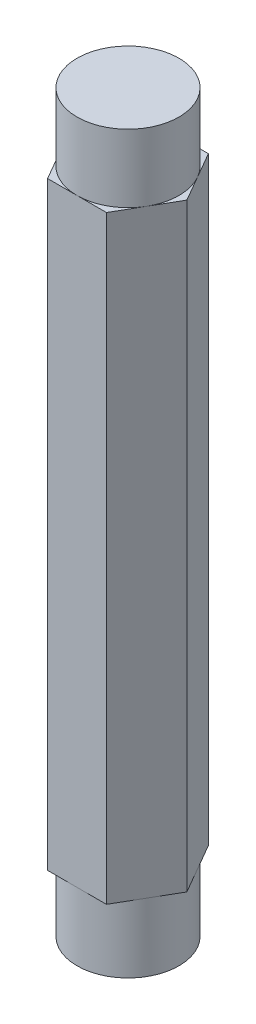
ISO-10303-21;
HEADER;
FILE_DESCRIPTION(('STEP AP214'),'2;1');
FILE_NAME('part.step','',(''),(''),'','','');
FILE_SCHEMA(('AUTOMOTIVE_DESIGN { 1 0 10303 214 1 1 1 1 }'));
ENDSEC;
DATA;
#1=APPLICATION_CONTEXT('core data for automotive mechanical design processes');
#2=APPLICATION_PROTOCOL_DEFINITION('international standard','automotive_design',2000,#1);
#3=PRODUCT_CONTEXT('',#1,'mechanical');
#4=PRODUCT('Part','Part','',(#3));
#5=PRODUCT_RELATED_PRODUCT_CATEGORY('part','',(#4));
#6=PRODUCT_DEFINITION_FORMATION('','',#4);
#7=PRODUCT_DEFINITION_CONTEXT('part definition',#1,'design');
#8=PRODUCT_DEFINITION('design','',#6,#7);
#9=PRODUCT_DEFINITION_SHAPE('','',#8);
#10=(LENGTH_UNIT() NAMED_UNIT(*) SI_UNIT(.MILLI.,.METRE.));
#11=(NAMED_UNIT(*) PLANE_ANGLE_UNIT() SI_UNIT($,.RADIAN.));
#12=(NAMED_UNIT(*) SI_UNIT($,.STERADIAN.) SOLID_ANGLE_UNIT());
#13=UNCERTAINTY_MEASURE_WITH_UNIT(LENGTH_MEASURE(1.E-05),#10,'distance_accuracy_value','');
#14=(GEOMETRIC_REPRESENTATION_CONTEXT(3) GLOBAL_UNCERTAINTY_ASSIGNED_CONTEXT((#13)) GLOBAL_UNIT_ASSIGNED_CONTEXT((#10,
#11,#12)) REPRESENTATION_CONTEXT('',''));
#15=CARTESIAN_POINT('',(0.,0.,0.));
#16=DIRECTION('',(0.,0.,1.));
#17=DIRECTION('',(1.,0.,0.));
#18=AXIS2_PLACEMENT_3D('',#15,#16,#17);
#19=CARTESIAN_POINT('',(0.,-13.9954,0.));
#20=DIRECTION('',(0.,1.,0.));
#21=DIRECTION('',(0.,0.,1.));
#22=AXIS2_PLACEMENT_3D('',#19,#20,#21);
#23=PLANE('',#22);
#24=DIRECTION('',(1.,0.,0.));
#25=VECTOR('',#24,1.);
#26=CARTESIAN_POINT('',(-1.3748153285078,-13.9954,2.38125));
#27=LINE('',#26,#25);
#28=CARTESIAN_POINT('',(0.,-13.9954,2.38125));
#29=VERTEX_POINT('',#28);
#30=CARTESIAN_POINT('',(1.3748153285078,-13.9954,2.38125));
#31=VERTEX_POINT('',#30);
#32=EDGE_CURVE('E140',#29,#31,#27,.T.);
#33=ORIENTED_EDGE('',*,*,#32,.F.);
#34=CARTESIAN_POINT('',(0.,-13.9954,0.));
#35=DIRECTION('',(0.,1.,0.));
#36=DIRECTION('',(0.,0.,1.));
#37=AXIS2_PLACEMENT_3D('',#34,#35,#36);
#38=CIRCLE('',#37,2.38125);
#39=CARTESIAN_POINT('',(2.06222299276169,-13.9954,1.190625));
#40=VERTEX_POINT('',#39);
#41=EDGE_CURVE('E51',#29,#40,#38,.T.);
#42=ORIENTED_EDGE('',*,*,#41,.T.);
#43=DIRECTION('',(0.5,0.,-0.866025403784439));
#44=VECTOR('',#43,1.);
#45=CARTESIAN_POINT('',(1.3748153285078,-13.9954,2.38125));
#46=LINE('',#45,#44);
#47=EDGE_CURVE('E138',#31,#40,#46,.T.);
#48=ORIENTED_EDGE('',*,*,#47,.F.);
#49=EDGE_LOOP('',(#33,#42,#48));
#50=FACE_BOUND('',#49,.T.);
#51=ADVANCED_FACE('F39',(#50),#23,.F.);
#52=CARTESIAN_POINT('',(2.74963065701559,-13.9954,0.));
#53=VERTEX_POINT('',#52);
#54=EDGE_CURVE('E145',#40,#53,#46,.T.);
#55=ORIENTED_EDGE('',*,*,#54,.F.);
#56=CARTESIAN_POINT('',(2.06222299276169,-13.9954,-1.190625));
#57=VERTEX_POINT('',#56);
#58=EDGE_CURVE('E11',#40,#57,#38,.T.);
#59=ORIENTED_EDGE('',*,*,#58,.T.);
#60=DIRECTION('',(-0.5,0.,-0.866025403784439));
#61=VECTOR('',#60,1.);
#62=CARTESIAN_POINT('',(2.74963065701559,-13.9954,0.));
#63=LINE('',#62,#61);
#64=EDGE_CURVE('E148',#53,#57,#63,.T.);
#65=ORIENTED_EDGE('',*,*,#64,.F.);
#66=EDGE_LOOP('',(#55,#59,#65));
#67=FACE_BOUND('',#66,.T.);
#68=ADVANCED_FACE('F146',(#67),#23,.F.);
#69=CARTESIAN_POINT('',(1.37481532850779,-13.9954,-2.38125));
#70=VERTEX_POINT('',#69);
#71=EDGE_CURVE('E159',#57,#70,#63,.T.);
#72=ORIENTED_EDGE('',*,*,#71,.F.);
#73=CARTESIAN_POINT('',(0.,-13.9954,-2.38125));
#74=VERTEX_POINT('',#73);
#75=EDGE_CURVE('E49',#57,#74,#38,.T.);
#76=ORIENTED_EDGE('',*,*,#75,.T.);
#77=DIRECTION('',(-1.,0.,0.));
#78=VECTOR('',#77,1.);
#79=CARTESIAN_POINT('',(1.37481532850779,-13.9954,-2.38125));
#80=LINE('',#79,#78);
#81=EDGE_CURVE('E167',#70,#74,#80,.T.);
#82=ORIENTED_EDGE('',*,*,#81,.F.);
#83=EDGE_LOOP('',(#72,#76,#82));
#84=FACE_BOUND('',#83,.T.);
#85=ADVANCED_FACE('F294',(#84),#23,.F.);
#86=CARTESIAN_POINT('',(-1.3748153285078,-13.9954,-2.38125));
#87=VERTEX_POINT('',#86);
#88=EDGE_CURVE('E166',#74,#87,#80,.T.);
#89=ORIENTED_EDGE('',*,*,#88,.F.);
#90=CARTESIAN_POINT('',(-2.06222299276169,-13.9954,-1.190625));
#91=VERTEX_POINT('',#90);
#92=EDGE_CURVE('E297',#74,#91,#38,.T.);
#93=ORIENTED_EDGE('',*,*,#92,.T.);
#94=DIRECTION('',(-0.5,0.,0.866025403784439));
#95=VECTOR('',#94,1.);
#96=CARTESIAN_POINT('',(-1.3748153285078,-13.9954,-2.38125));
#97=LINE('',#96,#95);
#98=EDGE_CURVE('E172',#87,#91,#97,.T.);
#99=ORIENTED_EDGE('',*,*,#98,.F.);
#100=EDGE_LOOP('',(#89,#93,#99));
#101=FACE_BOUND('',#100,.T.);
#102=ADVANCED_FACE('F301',(#101),#23,.F.);
#103=CARTESIAN_POINT('',(-2.74963065701559,-13.9954,0.));
#104=VERTEX_POINT('',#103);
#105=EDGE_CURVE('E171',#91,#104,#97,.T.);
#106=ORIENTED_EDGE('',*,*,#105,.F.);
#107=CARTESIAN_POINT('',(-2.06222299276169,-13.9954,1.190625));
#108=VERTEX_POINT('',#107);
#109=EDGE_CURVE('E229',#91,#108,#38,.T.);
#110=ORIENTED_EDGE('',*,*,#109,.T.);
#111=DIRECTION('',(0.5,0.,0.866025403784439));
#112=VECTOR('',#111,1.);
#113=CARTESIAN_POINT('',(-2.74963065701559,-13.9954,0.));
#114=LINE('',#113,#112);
#115=EDGE_CURVE('E177',#104,#108,#114,.T.);
#116=ORIENTED_EDGE('',*,*,#115,.F.);
#117=EDGE_LOOP('',(#106,#110,#116));
#118=FACE_BOUND('',#117,.T.);
#119=ADVANCED_FACE('F313',(#118),#23,.F.);
#120=CARTESIAN_POINT('',(0.,13.9954,0.));
#121=DIRECTION('',(0.,1.,0.));
#122=DIRECTION('',(0.,0.,1.));
#123=AXIS2_PLACEMENT_3D('',#120,#121,#122);
#124=PLANE('',#123);
#125=CARTESIAN_POINT('',(0.,13.9954,0.));
#126=DIRECTION('',(0.,1.,0.));
#127=DIRECTION('',(0.,0.,1.));
#128=AXIS2_PLACEMENT_3D('',#125,#126,#127);
#129=CIRCLE('',#128,2.38125);
#130=CARTESIAN_POINT('',(0.,13.9954,2.38125));
#131=VERTEX_POINT('',#130);
#132=CARTESIAN_POINT('',(2.06222299276169,13.9954,1.190625));
#133=VERTEX_POINT('',#132);
#134=EDGE_CURVE('E206',#131,#133,#129,.T.);
#135=ORIENTED_EDGE('',*,*,#134,.F.);
#136=DIRECTION('',(1.,0.,0.));
#137=VECTOR('',#136,1.);
#138=CARTESIAN_POINT('',(-1.3748153285078,13.9954,2.38125));
#139=LINE('',#138,#137);
#140=CARTESIAN_POINT('',(1.3748153285078,13.9954,2.38125));
#141=VERTEX_POINT('',#140);
#142=EDGE_CURVE('E181',#131,#141,#139,.T.);
#143=ORIENTED_EDGE('',*,*,#142,.T.);
#144=DIRECTION('',(0.5,0.,-0.866025403784439));
#145=VECTOR('',#144,1.);
#146=CARTESIAN_POINT('',(1.3748153285078,13.9954,2.38125));
#147=LINE('',#146,#145);
#148=EDGE_CURVE('E281',#141,#133,#147,.T.);
#149=ORIENTED_EDGE('',*,*,#148,.T.);
#150=EDGE_LOOP('',(#135,#143,#149));
#151=FACE_BOUND('',#150,.T.);
#152=ADVANCED_FACE('F329',(#151),#124,.T.);
#153=CARTESIAN_POINT('',(2.06222299276169,13.9954,-1.190625));
#154=VERTEX_POINT('',#153);
#155=EDGE_CURVE('E216',#133,#154,#129,.T.);
#156=ORIENTED_EDGE('',*,*,#155,.F.);
#157=CARTESIAN_POINT('',(2.74963065701559,13.9954,0.));
#158=VERTEX_POINT('',#157);
#159=EDGE_CURVE('E278',#133,#158,#147,.T.);
#160=ORIENTED_EDGE('',*,*,#159,.T.);
#161=DIRECTION('',(-0.5,0.,-0.866025403784439));
#162=VECTOR('',#161,1.);
#163=CARTESIAN_POINT('',(2.74963065701559,13.9954,0.));
#164=LINE('',#163,#162);
#165=EDGE_CURVE('E247',#158,#154,#164,.T.);
#166=ORIENTED_EDGE('',*,*,#165,.T.);
#167=EDGE_LOOP('',(#156,#160,#166));
#168=FACE_BOUND('',#167,.T.);
#169=ADVANCED_FACE('F289',(#168),#124,.T.);
#170=CARTESIAN_POINT('',(0.,13.9954,-2.38125));
#171=VERTEX_POINT('',#170);
#172=EDGE_CURVE('E225',#154,#171,#129,.T.);
#173=ORIENTED_EDGE('',*,*,#172,.F.);
#174=CARTESIAN_POINT('',(1.37481532850779,13.9954,-2.38125));
#175=VERTEX_POINT('',#174);
#176=EDGE_CURVE('E252',#154,#175,#164,.T.);
#177=ORIENTED_EDGE('',*,*,#176,.T.);
#178=DIRECTION('',(-1.,0.,0.));
#179=VECTOR('',#178,1.);
#180=CARTESIAN_POINT('',(1.37481532850779,13.9954,-2.38125));
#181=LINE('',#180,#179);
#182=EDGE_CURVE('E245',#175,#171,#181,.T.);
#183=ORIENTED_EDGE('',*,*,#182,.T.);
#184=EDGE_LOOP('',(#173,#177,#183));
#185=FACE_BOUND('',#184,.T.);
#186=ADVANCED_FACE('F250',(#185),#124,.T.);
#187=CARTESIAN_POINT('',(-2.06222299276169,13.9954,-1.190625));
#188=VERTEX_POINT('',#187);
#189=EDGE_CURVE('E211',#171,#188,#129,.T.);
#190=ORIENTED_EDGE('',*,*,#189,.F.);
#191=CARTESIAN_POINT('',(-1.3748153285078,13.9954,-2.38125));
#192=VERTEX_POINT('',#191);
#193=EDGE_CURVE('E237',#171,#192,#181,.T.);
#194=ORIENTED_EDGE('',*,*,#193,.T.);
#195=DIRECTION('',(-0.5,0.,0.866025403784439));
#196=VECTOR('',#195,1.);
#197=CARTESIAN_POINT('',(-1.3748153285078,13.9954,-2.38125));
#198=LINE('',#197,#196);
#199=EDGE_CURVE('E240',#192,#188,#198,.T.);
#200=ORIENTED_EDGE('',*,*,#199,.T.);
#201=EDGE_LOOP('',(#190,#194,#200));
#202=FACE_BOUND('',#201,.T.);
#203=ADVANCED_FACE('F236',(#202),#124,.T.);
#204=CARTESIAN_POINT('',(-2.06222299276169,13.9954,1.190625));
#205=VERTEX_POINT('',#204);
#206=EDGE_CURVE('E204',#188,#205,#129,.T.);
#207=ORIENTED_EDGE('',*,*,#206,.F.);
#208=CARTESIAN_POINT('',(-2.74963065701559,13.9954,0.));
#209=VERTEX_POINT('',#208);
#210=EDGE_CURVE('E255',#188,#209,#198,.T.);
#211=ORIENTED_EDGE('',*,*,#210,.T.);
#212=DIRECTION('',(0.5,0.,0.866025403784439));
#213=VECTOR('',#212,1.);
#214=CARTESIAN_POINT('',(-2.74963065701559,13.9954,0.));
#215=LINE('',#214,#213);
#216=EDGE_CURVE('E187',#209,#205,#215,.T.);
#217=ORIENTED_EDGE('',*,*,#216,.T.);
#218=EDGE_LOOP('',(#207,#211,#217));
#219=FACE_BOUND('',#218,.T.);
#220=ADVANCED_FACE('F330',(#219),#124,.T.);
#221=CARTESIAN_POINT('',(-1.3748153285078,13.9954,2.38125));
#222=DIRECTION('',(0.,0.,-1.));
#223=DIRECTION('',(-1.,0.,0.));
#224=AXIS2_PLACEMENT_3D('',#221,#222,#223);
#225=PLANE('',#224);
#226=CARTESIAN_POINT('',(-1.3748153285078,-13.9954,2.38125));
#227=VERTEX_POINT('',#226);
#228=EDGE_CURVE('E153',#227,#29,#27,.T.);
#229=ORIENTED_EDGE('',*,*,#228,.T.);
#230=ORIENTED_EDGE('',*,*,#32,.T.);
#231=DIRECTION('',(0.,-1.,0.));
#232=VECTOR('',#231,1.);
#233=CARTESIAN_POINT('',(1.3748153285078,13.9954,2.38125));
#234=LINE('',#233,#232);
#235=EDGE_CURVE('E43',#141,#31,#234,.T.);
#236=ORIENTED_EDGE('',*,*,#235,.F.);
#237=ORIENTED_EDGE('',*,*,#142,.F.);
#238=CARTESIAN_POINT('',(-1.3748153285078,13.9954,2.38125));
#239=VERTEX_POINT('',#238);
#240=EDGE_CURVE('E270',#239,#131,#139,.T.);
#241=ORIENTED_EDGE('',*,*,#240,.F.);
#242=DIRECTION('',(0.,-1.,0.));
#243=VECTOR('',#242,1.);
#244=CARTESIAN_POINT('',(-1.3748153285078,13.9954,2.38125));
#245=LINE('',#244,#243);
#246=EDGE_CURVE('E182',#239,#227,#245,.T.);
#247=ORIENTED_EDGE('',*,*,#246,.T.);
#248=EDGE_LOOP('',(#229,#230,#236,#237,#241,#247));
#249=FACE_BOUND('',#248,.T.);
#250=ADVANCED_FACE('F41',(#249),#225,.F.);
#251=CARTESIAN_POINT('',(1.3748153285078,13.9954,2.38125));
#252=DIRECTION('',(-0.866025403784439,0.,-0.5));
#253=DIRECTION('',(-0.5,0.,0.866025403784439));
#254=AXIS2_PLACEMENT_3D('',#251,#252,#253);
#255=PLANE('',#254);
#256=ORIENTED_EDGE('',*,*,#47,.T.);
#257=ORIENTED_EDGE('',*,*,#54,.T.);
#258=DIRECTION('',(0.,-1.,0.));
#259=VECTOR('',#258,1.);
#260=CARTESIAN_POINT('',(2.74963065701559,13.9954,0.));
#261=LINE('',#260,#259);
#262=EDGE_CURVE('E198',#158,#53,#261,.T.);
#263=ORIENTED_EDGE('',*,*,#262,.F.);
#264=ORIENTED_EDGE('',*,*,#159,.F.);
#265=ORIENTED_EDGE('',*,*,#148,.F.);
#266=ORIENTED_EDGE('',*,*,#235,.T.);
#267=EDGE_LOOP('',(#256,#257,#263,#264,#265,#266));
#268=FACE_BOUND('',#267,.T.);
#269=ADVANCED_FACE('F155',(#268),#255,.F.);
#270=CARTESIAN_POINT('',(2.74963065701559,13.9954,0.));
#271=DIRECTION('',(-0.866025403784439,0.,0.5));
#272=DIRECTION('',(0.5,0.,0.866025403784439));
#273=AXIS2_PLACEMENT_3D('',#270,#271,#272);
#274=PLANE('',#273);
#275=ORIENTED_EDGE('',*,*,#64,.T.);
#276=ORIENTED_EDGE('',*,*,#71,.T.);
#277=DIRECTION('',(0.,-1.,0.));
#278=VECTOR('',#277,1.);
#279=CARTESIAN_POINT('',(1.37481532850779,13.9954,-2.38125));
#280=LINE('',#279,#278);
#281=EDGE_CURVE('E195',#175,#70,#280,.T.);
#282=ORIENTED_EDGE('',*,*,#281,.F.);
#283=ORIENTED_EDGE('',*,*,#176,.F.);
#284=ORIENTED_EDGE('',*,*,#165,.F.);
#285=ORIENTED_EDGE('',*,*,#262,.T.);
#286=EDGE_LOOP('',(#275,#276,#282,#283,#284,#285));
#287=FACE_BOUND('',#286,.T.);
#288=ADVANCED_FACE('F291',(#287),#274,.F.);
#289=CARTESIAN_POINT('',(1.37481532850779,13.9954,-2.38125));
#290=DIRECTION('',(0.,0.,1.));
#291=DIRECTION('',(1.,0.,0.));
#292=AXIS2_PLACEMENT_3D('',#289,#290,#291);
#293=PLANE('',#292);
#294=ORIENTED_EDGE('',*,*,#81,.T.);
#295=ORIENTED_EDGE('',*,*,#88,.T.);
#296=DIRECTION('',(0.,-1.,0.));
#297=VECTOR('',#296,1.);
#298=CARTESIAN_POINT('',(-1.3748153285078,13.9954,-2.38125));
#299=LINE('',#298,#297);
#300=EDGE_CURVE('E191',#192,#87,#299,.T.);
#301=ORIENTED_EDGE('',*,*,#300,.F.);
#302=ORIENTED_EDGE('',*,*,#193,.F.);
#303=ORIENTED_EDGE('',*,*,#182,.F.);
#304=ORIENTED_EDGE('',*,*,#281,.T.);
#305=EDGE_LOOP('',(#294,#295,#301,#302,#303,#304));
#306=FACE_BOUND('',#305,.T.);
#307=ADVANCED_FACE('F244',(#306),#293,.F.);
#308=CARTESIAN_POINT('',(-1.3748153285078,13.9954,-2.38125));
#309=DIRECTION('',(0.866025403784439,0.,0.5));
#310=DIRECTION('',(0.5,0.,-0.866025403784439));
#311=AXIS2_PLACEMENT_3D('',#308,#309,#310);
#312=PLANE('',#311);
#313=ORIENTED_EDGE('',*,*,#98,.T.);
#314=ORIENTED_EDGE('',*,*,#105,.T.);
#315=DIRECTION('',(0.,-1.,0.));
#316=VECTOR('',#315,1.);
#317=CARTESIAN_POINT('',(-2.74963065701559,13.9954,0.));
#318=LINE('',#317,#316);
#319=EDGE_CURVE('E186',#209,#104,#318,.T.);
#320=ORIENTED_EDGE('',*,*,#319,.F.);
#321=ORIENTED_EDGE('',*,*,#210,.F.);
#322=ORIENTED_EDGE('',*,*,#199,.F.);
#323=ORIENTED_EDGE('',*,*,#300,.T.);
#324=EDGE_LOOP('',(#313,#314,#320,#321,#322,#323));
#325=FACE_BOUND('',#324,.T.);
#326=ADVANCED_FACE('F308',(#325),#312,.F.);
#327=CARTESIAN_POINT('',(-2.74963065701559,13.9954,0.));
#328=DIRECTION('',(0.866025403784439,0.,-0.5));
#329=DIRECTION('',(-0.5,0.,-0.866025403784439));
#330=AXIS2_PLACEMENT_3D('',#327,#328,#329);
#331=PLANE('',#330);
#332=ORIENTED_EDGE('',*,*,#115,.T.);
#333=EDGE_CURVE('E176',#108,#227,#114,.T.);
#334=ORIENTED_EDGE('',*,*,#333,.T.);
#335=ORIENTED_EDGE('',*,*,#246,.F.);
#336=EDGE_CURVE('E261',#205,#239,#215,.T.);
#337=ORIENTED_EDGE('',*,*,#336,.F.);
#338=ORIENTED_EDGE('',*,*,#216,.F.);
#339=ORIENTED_EDGE('',*,*,#319,.T.);
#340=EDGE_LOOP('',(#332,#334,#335,#337,#338,#339));
#341=FACE_BOUND('',#340,.T.);
#342=ADVANCED_FACE('F273',(#341),#331,.F.);
#343=EDGE_CURVE('E65',#205,#131,#129,.T.);
#344=ORIENTED_EDGE('',*,*,#343,.F.);
#345=ORIENTED_EDGE('',*,*,#336,.T.);
#346=ORIENTED_EDGE('',*,*,#240,.T.);
#347=EDGE_LOOP('',(#344,#345,#346));
#348=FACE_BOUND('',#347,.T.);
#349=ADVANCED_FACE('F268',(#348),#124,.T.);
#350=ORIENTED_EDGE('',*,*,#333,.F.);
#351=EDGE_CURVE('E144',#108,#29,#38,.T.);
#352=ORIENTED_EDGE('',*,*,#351,.T.);
#353=ORIENTED_EDGE('',*,*,#228,.F.);
#354=EDGE_LOOP('',(#350,#352,#353));
#355=FACE_BOUND('',#354,.T.);
#356=ADVANCED_FACE('F316',(#355),#23,.F.);
#357=CARTESIAN_POINT('',(0.,17.1704,0.));
#358=DIRECTION('',(0.,-1.,0.));
#359=DIRECTION('',(0.,0.,-1.));
#360=AXIS2_PLACEMENT_3D('',#357,#358,#359);
#361=CYLINDRICAL_SURFACE('',#360,2.38125);
#362=CARTESIAN_POINT('',(0.,17.1704,0.));
#363=DIRECTION('',(0.,1.,0.));
#364=DIRECTION('',(0.,0.,1.));
#365=AXIS2_PLACEMENT_3D('',#362,#363,#364);
#366=CIRCLE('',#365,2.38125);
#367=CARTESIAN_POINT('',(0.,17.1704,2.38125));
#368=VERTEX_POINT('',#367);
#369=EDGE_CURVE('E215',#368,#368,#366,.T.);
#370=ORIENTED_EDGE('',*,*,#369,.F.);
#371=EDGE_LOOP('',(#370));
#372=FACE_BOUND('',#371,.T.);
#373=ORIENTED_EDGE('',*,*,#134,.T.);
#374=ORIENTED_EDGE('',*,*,#155,.T.);
#375=ORIENTED_EDGE('',*,*,#172,.T.);
#376=ORIENTED_EDGE('',*,*,#189,.T.);
#377=ORIENTED_EDGE('',*,*,#206,.T.);
#378=ORIENTED_EDGE('',*,*,#343,.T.);
#379=EDGE_LOOP('',(#373,#374,#375,#376,#377,#378));
#380=FACE_BOUND('',#379,.T.);
#381=ADVANCED_FACE('F232',(#372,#380),#361,.T.);
#382=CARTESIAN_POINT('',(0.,17.1704,0.));
#383=DIRECTION('',(0.,1.,0.));
#384=DIRECTION('',(0.,0.,1.));
#385=AXIS2_PLACEMENT_3D('',#382,#383,#384);
#386=PLANE('',#385);
#387=ORIENTED_EDGE('',*,*,#369,.T.);
#388=EDGE_LOOP('',(#387));
#389=FACE_BOUND('',#388,.T.);
#390=ADVANCED_FACE('F325',(#389),#386,.T.);
#391=CARTESIAN_POINT('',(0.,-17.1704,0.));
#392=DIRECTION('',(0.,1.,0.));
#393=DIRECTION('',(0.,0.,1.));
#394=AXIS2_PLACEMENT_3D('',#391,#392,#393);
#395=CYLINDRICAL_SURFACE('',#394,2.38125);
#396=CARTESIAN_POINT('',(0.,-17.1704,0.));
#397=DIRECTION('',(0.,1.,0.));
#398=DIRECTION('',(0.,0.,1.));
#399=AXIS2_PLACEMENT_3D('',#396,#397,#398);
#400=CIRCLE('',#399,2.38125);
#401=CARTESIAN_POINT('',(0.,-17.1704,2.38125));
#402=VERTEX_POINT('',#401);
#403=EDGE_CURVE('E143',#402,#402,#400,.T.);
#404=ORIENTED_EDGE('',*,*,#403,.T.);
#405=EDGE_LOOP('',(#404));
#406=FACE_BOUND('',#405,.T.);
#407=ORIENTED_EDGE('',*,*,#41,.F.);
#408=ORIENTED_EDGE('',*,*,#351,.F.);
#409=ORIENTED_EDGE('',*,*,#109,.F.);
#410=ORIENTED_EDGE('',*,*,#92,.F.);
#411=ORIENTED_EDGE('',*,*,#75,.F.);
#412=ORIENTED_EDGE('',*,*,#58,.F.);
#413=EDGE_LOOP('',(#407,#408,#409,#410,#411,#412));
#414=FACE_BOUND('',#413,.T.);
#415=ADVANCED_FACE('F128',(#406,#414),#395,.T.);
#416=CARTESIAN_POINT('',(0.,-17.1704,0.));
#417=DIRECTION('',(0.,-1.,0.));
#418=DIRECTION('',(0.,0.,1.));
#419=AXIS2_PLACEMENT_3D('',#416,#417,#418);
#420=PLANE('',#419);
#421=ORIENTED_EDGE('',*,*,#403,.F.);
#422=EDGE_LOOP('',(#421));
#423=FACE_BOUND('',#422,.T.);
#424=ADVANCED_FACE('F418',(#423),#420,.T.);
#425=CLOSED_SHELL('',(#51,#68,#85,#102,#119,#152,#169,#186,#203,#220,#250,#269,#288,#307,#326,
#342,#349,#356,#381,#390,#415,#424));
#426=MANIFOLD_SOLID_BREP('B2',#425);
#427=ADVANCED_BREP_SHAPE_REPRESENTATION('',(#18,#426),#14);
#428=SHAPE_DEFINITION_REPRESENTATION(#9,#427);
ENDSEC;
END-ISO-10303-21;
